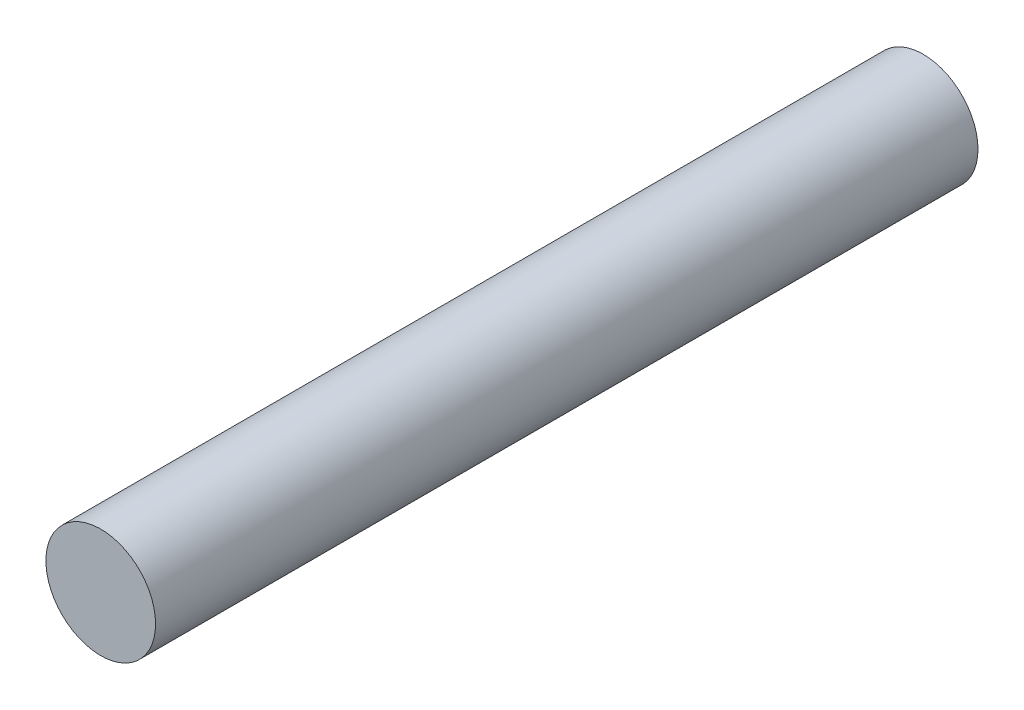
ISO-10303-21;
HEADER;
FILE_DESCRIPTION(('STEP AP214'),'2;1');
FILE_NAME('part.step','',(''),(''),'','','');
FILE_SCHEMA(('AUTOMOTIVE_DESIGN { 1 0 10303 214 1 1 1 1 }'));
ENDSEC;
DATA;
#1=APPLICATION_CONTEXT('core data for automotive mechanical design processes');
#2=APPLICATION_PROTOCOL_DEFINITION('international standard','automotive_design',2000,#1);
#3=PRODUCT_CONTEXT('',#1,'mechanical');
#4=PRODUCT('Part','Part','',(#3));
#5=PRODUCT_RELATED_PRODUCT_CATEGORY('part','',(#4));
#6=PRODUCT_DEFINITION_FORMATION('','',#4);
#7=PRODUCT_DEFINITION_CONTEXT('part definition',#1,'design');
#8=PRODUCT_DEFINITION('design','',#6,#7);
#9=PRODUCT_DEFINITION_SHAPE('','',#8);
#10=(LENGTH_UNIT() NAMED_UNIT(*) SI_UNIT(.MILLI.,.METRE.));
#11=(NAMED_UNIT(*) PLANE_ANGLE_UNIT() SI_UNIT($,.RADIAN.));
#12=(NAMED_UNIT(*) SI_UNIT($,.STERADIAN.) SOLID_ANGLE_UNIT());
#13=UNCERTAINTY_MEASURE_WITH_UNIT(LENGTH_MEASURE(1.E-05),#10,'distance_accuracy_value','');
#14=(GEOMETRIC_REPRESENTATION_CONTEXT(3) GLOBAL_UNCERTAINTY_ASSIGNED_CONTEXT((#13)) GLOBAL_UNIT_ASSIGNED_CONTEXT((#10,
#11,#12)) REPRESENTATION_CONTEXT('',''));
#15=CARTESIAN_POINT('',(0.,0.,0.));
#16=DIRECTION('',(0.,0.,1.));
#17=DIRECTION('',(1.,0.,0.));
#18=AXIS2_PLACEMENT_3D('',#15,#16,#17);
#19=CARTESIAN_POINT('',(0.,0.,38.1));
#20=DIRECTION('',(0.,0.,-1.));
#21=DIRECTION('',(-1.,0.,0.));
#22=AXIS2_PLACEMENT_3D('',#19,#20,#21);
#23=CYLINDRICAL_SURFACE('',#22,2.54);
#24=CARTESIAN_POINT('',(0.,0.,38.1));
#25=DIRECTION('',(0.,0.,1.));
#26=DIRECTION('',(1.,0.,0.));
#27=AXIS2_PLACEMENT_3D('',#24,#25,#26);
#28=CIRCLE('',#27,2.54);
#29=CARTESIAN_POINT('',(2.54,0.,38.1));
#30=VERTEX_POINT('',#29);
#31=EDGE_CURVE('E10',#30,#30,#28,.T.);
#32=ORIENTED_EDGE('',*,*,#31,.F.);
#33=EDGE_LOOP('',(#32));
#34=FACE_BOUND('',#33,.T.);
#35=CARTESIAN_POINT('',(0.,0.,0.));
#36=DIRECTION('',(0.,0.,1.));
#37=DIRECTION('',(1.,0.,0.));
#38=AXIS2_PLACEMENT_3D('',#35,#36,#37);
#39=CIRCLE('',#38,2.54);
#40=CARTESIAN_POINT('',(2.54,0.,0.));
#41=VERTEX_POINT('',#40);
#42=EDGE_CURVE('E34',#41,#41,#39,.T.);
#43=ORIENTED_EDGE('',*,*,#42,.T.);
#44=EDGE_LOOP('',(#43));
#45=FACE_BOUND('',#44,.T.);
#46=ADVANCED_FACE('F31',(#34,#45),#23,.T.);
#47=CARTESIAN_POINT('',(0.,0.,38.1));
#48=DIRECTION('',(0.,0.,1.));
#49=DIRECTION('',(1.,0.,0.));
#50=AXIS2_PLACEMENT_3D('',#47,#48,#49);
#51=PLANE('',#50);
#52=ORIENTED_EDGE('',*,*,#31,.T.);
#53=EDGE_LOOP('',(#52));
#54=FACE_BOUND('',#53,.T.);
#55=ADVANCED_FACE('F46',(#54),#51,.T.);
#56=CARTESIAN_POINT('',(0.,0.,0.));
#57=DIRECTION('',(0.,0.,1.));
#58=DIRECTION('',(1.,0.,0.));
#59=AXIS2_PLACEMENT_3D('',#56,#57,#58);
#60=PLANE('',#59);
#61=ORIENTED_EDGE('',*,*,#42,.F.);
#62=EDGE_LOOP('',(#61));
#63=FACE_BOUND('',#62,.T.);
#64=ADVANCED_FACE('F44',(#63),#60,.F.);
#65=CLOSED_SHELL('',(#46,#55,#64));
#66=MANIFOLD_SOLID_BREP('B2',#65);
#67=ADVANCED_BREP_SHAPE_REPRESENTATION('',(#18,#66),#14);
#68=SHAPE_DEFINITION_REPRESENTATION(#9,#67);
ENDSEC;
END-ISO-10303-21;
